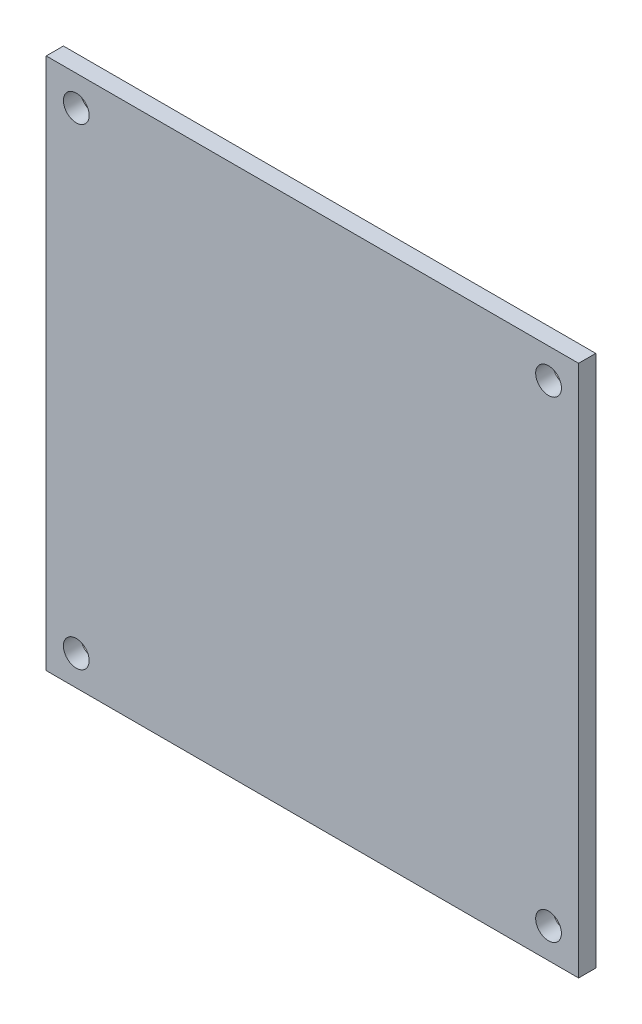
ISO-10303-21;
HEADER;
FILE_DESCRIPTION(('STEP AP214'),'2;1');
FILE_NAME('part.step','',(''),(''),'','','');
FILE_SCHEMA(('AUTOMOTIVE_DESIGN { 1 0 10303 214 1 1 1 1 }'));
ENDSEC;
DATA;
#1=APPLICATION_CONTEXT('core data for automotive mechanical design processes');
#2=APPLICATION_PROTOCOL_DEFINITION('international standard','automotive_design',2000,#1);
#3=PRODUCT_CONTEXT('',#1,'mechanical');
#4=PRODUCT('Part','Part','',(#3));
#5=PRODUCT_RELATED_PRODUCT_CATEGORY('part','',(#4));
#6=PRODUCT_DEFINITION_FORMATION('','',#4);
#7=PRODUCT_DEFINITION_CONTEXT('part definition',#1,'design');
#8=PRODUCT_DEFINITION('design','',#6,#7);
#9=PRODUCT_DEFINITION_SHAPE('','',#8);
#10=(LENGTH_UNIT() NAMED_UNIT(*) SI_UNIT(.MILLI.,.METRE.));
#11=(NAMED_UNIT(*) PLANE_ANGLE_UNIT() SI_UNIT($,.RADIAN.));
#12=(NAMED_UNIT(*) SI_UNIT($,.STERADIAN.) SOLID_ANGLE_UNIT());
#13=UNCERTAINTY_MEASURE_WITH_UNIT(LENGTH_MEASURE(1.E-05),#10,'distance_accuracy_value','');
#14=(GEOMETRIC_REPRESENTATION_CONTEXT(3) GLOBAL_UNCERTAINTY_ASSIGNED_CONTEXT((#13)) GLOBAL_UNIT_ASSIGNED_CONTEXT((#10,
#11,#12)) REPRESENTATION_CONTEXT('',''));
#15=CARTESIAN_POINT('',(0.,0.,0.));
#16=DIRECTION('',(0.,0.,1.));
#17=DIRECTION('',(1.,0.,0.));
#18=AXIS2_PLACEMENT_3D('',#15,#16,#17);
#19=CARTESIAN_POINT('',(0.,0.,0.));
#20=DIRECTION('',(0.,0.,1.));
#21=DIRECTION('',(1.,0.,0.));
#22=AXIS2_PLACEMENT_3D('',#19,#20,#21);
#23=PLANE('',#22);
#24=DIRECTION('',(0.,-1.,0.));
#25=VECTOR('',#24,1.);
#26=CARTESIAN_POINT('',(-89.1418845188909,30.4888268156425,0.));
#27=LINE('',#26,#25);
#28=CARTESIAN_POINT('',(-89.1418845188909,30.4888268156425,0.));
#29=VERTEX_POINT('',#28);
#30=CARTESIAN_POINT('',(-89.1418845188909,-31.5111731843575,0.));
#31=VERTEX_POINT('',#30);
#32=EDGE_CURVE('E212',#29,#31,#27,.T.);
#33=ORIENTED_EDGE('',*,*,#32,.F.);
#34=DIRECTION('',(-1.,0.,0.));
#35=VECTOR('',#34,1.);
#36=CARTESIAN_POINT('',(-89.1418845188909,30.4888268156425,0.));
#37=LINE('',#36,#35);
#38=CARTESIAN_POINT('',(-27.1418845188909,30.4888268156425,0.));
#39=VERTEX_POINT('',#38);
#40=EDGE_CURVE('E219',#39,#29,#37,.T.);
#41=ORIENTED_EDGE('',*,*,#40,.F.);
#42=DIRECTION('',(0.,1.,0.));
#43=VECTOR('',#42,1.);
#44=CARTESIAN_POINT('',(-27.1418845188909,30.4888268156425,0.));
#45=LINE('',#44,#43);
#46=CARTESIAN_POINT('',(-27.1418845188909,-31.5111731843575,0.));
#47=VERTEX_POINT('',#46);
#48=EDGE_CURVE('E230',#47,#39,#45,.T.);
#49=ORIENTED_EDGE('',*,*,#48,.F.);
#50=DIRECTION('',(1.,0.,0.));
#51=VECTOR('',#50,1.);
#52=CARTESIAN_POINT('',(-89.1418845188909,-31.5111731843575,0.));
#53=LINE('',#52,#51);
#54=EDGE_CURVE('E228',#31,#47,#53,.T.);
#55=ORIENTED_EDGE('',*,*,#54,.F.);
#56=EDGE_LOOP('',(#33,#41,#49,#55));
#57=FACE_BOUND('',#56,.T.);
#58=CARTESIAN_POINT('',(-85.6418845188909,26.9888268156425,0.));
#59=DIRECTION('',(0.,0.,1.));
#60=DIRECTION('',(1.,0.,0.));
#61=AXIS2_PLACEMENT_3D('',#58,#59,#60);
#62=CIRCLE('',#61,1.5);
#63=CARTESIAN_POINT('',(-84.1418845188909,26.9888268156425,0.));
#64=VERTEX_POINT('',#63);
#65=EDGE_CURVE('E206',#64,#64,#62,.T.);
#66=ORIENTED_EDGE('',*,*,#65,.T.);
#67=EDGE_LOOP('',(#66));
#68=FACE_BOUND('',#67,.T.);
#69=CARTESIAN_POINT('',(-30.6418845188909,26.9888268156425,0.));
#70=DIRECTION('',(0.,0.,1.));
#71=DIRECTION('',(1.,0.,0.));
#72=AXIS2_PLACEMENT_3D('',#69,#70,#71);
#73=CIRCLE('',#72,1.5);
#74=CARTESIAN_POINT('',(-29.1418845188909,26.9888268156425,0.));
#75=VERTEX_POINT('',#74);
#76=EDGE_CURVE('E200',#75,#75,#73,.T.);
#77=ORIENTED_EDGE('',*,*,#76,.T.);
#78=EDGE_LOOP('',(#77));
#79=FACE_BOUND('',#78,.T.);
#80=CARTESIAN_POINT('',(-30.6418845188903,-28.0111731843575,0.));
#81=DIRECTION('',(0.,0.,1.));
#82=DIRECTION('',(1.,0.,0.));
#83=AXIS2_PLACEMENT_3D('',#80,#81,#82);
#84=CIRCLE('',#83,1.5);
#85=CARTESIAN_POINT('',(-29.1418845188903,-28.0111731843575,0.));
#86=VERTEX_POINT('',#85);
#87=EDGE_CURVE('E194',#86,#86,#84,.T.);
#88=ORIENTED_EDGE('',*,*,#87,.T.);
#89=EDGE_LOOP('',(#88));
#90=FACE_BOUND('',#89,.T.);
#91=CARTESIAN_POINT('',(-85.6418845188903,-28.0111731843575,0.));
#92=DIRECTION('',(0.,0.,1.));
#93=DIRECTION('',(1.,0.,0.));
#94=AXIS2_PLACEMENT_3D('',#91,#92,#93);
#95=CIRCLE('',#94,1.5);
#96=CARTESIAN_POINT('',(-84.1418845188903,-28.0111731843575,0.));
#97=VERTEX_POINT('',#96);
#98=EDGE_CURVE('E190',#97,#97,#95,.T.);
#99=ORIENTED_EDGE('',*,*,#98,.T.);
#100=EDGE_LOOP('',(#99));
#101=FACE_BOUND('',#100,.T.);
#102=DIRECTION('',(0.,1.,0.));
#103=VECTOR('',#102,1.);
#104=CARTESIAN_POINT('',(-84.1418845188909,-12.0111731843575,0.));
#105=LINE('',#104,#103);
#106=CARTESIAN_POINT('',(-84.1418845188909,-12.0111731843575,0.));
#107=VERTEX_POINT('',#106);
#108=CARTESIAN_POINT('',(-84.1418845188909,10.9888268156425,0.));
#109=VERTEX_POINT('',#108);
#110=EDGE_CURVE('E139',#107,#109,#105,.T.);
#111=ORIENTED_EDGE('',*,*,#110,.F.);
#112=DIRECTION('',(-1.,0.,0.));
#113=VECTOR('',#112,1.);
#114=CARTESIAN_POINT('',(-84.1418845188909,-12.0111731843575,0.));
#115=LINE('',#114,#113);
#116=CARTESIAN_POINT('',(-78.1418845188909,-12.0111731843575,0.));
#117=VERTEX_POINT('',#116);
#118=EDGE_CURVE('E167',#117,#107,#115,.T.);
#119=ORIENTED_EDGE('',*,*,#118,.F.);
#120=DIRECTION('',(0.,-1.,0.));
#121=VECTOR('',#120,1.);
#122=CARTESIAN_POINT('',(-78.1418845188909,-12.0111731843575,0.));
#123=LINE('',#122,#121);
#124=CARTESIAN_POINT('',(-78.1418845188909,10.9888268156425,0.));
#125=VERTEX_POINT('',#124);
#126=EDGE_CURVE('E53',#125,#117,#123,.T.);
#127=ORIENTED_EDGE('',*,*,#126,.F.);
#128=DIRECTION('',(1.,0.,0.));
#129=VECTOR('',#128,1.);
#130=CARTESIAN_POINT('',(-84.1418845188909,10.9888268156425,0.));
#131=LINE('',#130,#129);
#132=EDGE_CURVE('E48',#109,#125,#131,.T.);
#133=ORIENTED_EDGE('',*,*,#132,.F.);
#134=EDGE_LOOP('',(#111,#119,#127,#133));
#135=FACE_BOUND('',#134,.T.);
#136=ADVANCED_FACE('F33',(#57,#68,#79,#90,#101,#135),#23,.F.);
#137=CARTESIAN_POINT('',(0.,0.,2.));
#138=DIRECTION('',(0.,0.,1.));
#139=DIRECTION('',(1.,0.,0.));
#140=AXIS2_PLACEMENT_3D('',#137,#138,#139);
#141=PLANE('',#140);
#142=CARTESIAN_POINT('',(-30.6418845188903,-28.0111731843575,2.));
#143=DIRECTION('',(0.,0.,1.));
#144=DIRECTION('',(1.,0.,0.));
#145=AXIS2_PLACEMENT_3D('',#142,#143,#144);
#146=CIRCLE('',#145,1.5);
#147=CARTESIAN_POINT('',(-29.1418845188903,-28.0111731843575,2.));
#148=VERTEX_POINT('',#147);
#149=EDGE_CURVE('E197',#148,#148,#146,.T.);
#150=ORIENTED_EDGE('',*,*,#149,.F.);
#151=EDGE_LOOP('',(#150));
#152=FACE_BOUND('',#151,.T.);
#153=CARTESIAN_POINT('',(-85.6418845188909,26.9888268156425,2.));
#154=DIRECTION('',(0.,0.,1.));
#155=DIRECTION('',(1.,0.,0.));
#156=AXIS2_PLACEMENT_3D('',#153,#154,#155);
#157=CIRCLE('',#156,1.5);
#158=CARTESIAN_POINT('',(-84.1418845188909,26.9888268156425,2.));
#159=VERTEX_POINT('',#158);
#160=EDGE_CURVE('E209',#159,#159,#157,.T.);
#161=ORIENTED_EDGE('',*,*,#160,.F.);
#162=EDGE_LOOP('',(#161));
#163=FACE_BOUND('',#162,.T.);
#164=DIRECTION('',(0.,-1.,0.));
#165=VECTOR('',#164,1.);
#166=CARTESIAN_POINT('',(-89.1418845188909,30.4888268156425,2.));
#167=LINE('',#166,#165);
#168=CARTESIAN_POINT('',(-89.1418845188909,30.4888268156425,2.));
#169=VERTEX_POINT('',#168);
#170=CARTESIAN_POINT('',(-89.1418845188909,-31.5111731843575,2.));
#171=VERTEX_POINT('',#170);
#172=EDGE_CURVE('E215',#169,#171,#167,.T.);
#173=ORIENTED_EDGE('',*,*,#172,.T.);
#174=DIRECTION('',(1.,0.,0.));
#175=VECTOR('',#174,1.);
#176=CARTESIAN_POINT('',(-89.1418845188909,-31.5111731843575,2.));
#177=LINE('',#176,#175);
#178=CARTESIAN_POINT('',(-27.1418845188909,-31.5111731843575,2.));
#179=VERTEX_POINT('',#178);
#180=EDGE_CURVE('E218',#171,#179,#177,.T.);
#181=ORIENTED_EDGE('',*,*,#180,.T.);
#182=DIRECTION('',(0.,1.,0.));
#183=VECTOR('',#182,1.);
#184=CARTESIAN_POINT('',(-27.1418845188909,30.4888268156425,2.));
#185=LINE('',#184,#183);
#186=CARTESIAN_POINT('',(-27.1418845188909,30.4888268156425,2.));
#187=VERTEX_POINT('',#186);
#188=EDGE_CURVE('E221',#179,#187,#185,.T.);
#189=ORIENTED_EDGE('',*,*,#188,.T.);
#190=DIRECTION('',(-1.,0.,0.));
#191=VECTOR('',#190,1.);
#192=CARTESIAN_POINT('',(-89.1418845188909,30.4888268156425,2.));
#193=LINE('',#192,#191);
#194=EDGE_CURVE('E223',#187,#169,#193,.T.);
#195=ORIENTED_EDGE('',*,*,#194,.T.);
#196=EDGE_LOOP('',(#173,#181,#189,#195));
#197=FACE_BOUND('',#196,.T.);
#198=CARTESIAN_POINT('',(-30.6418845188909,26.9888268156425,2.));
#199=DIRECTION('',(0.,0.,1.));
#200=DIRECTION('',(1.,0.,0.));
#201=AXIS2_PLACEMENT_3D('',#198,#199,#200);
#202=CIRCLE('',#201,1.5);
#203=CARTESIAN_POINT('',(-29.1418845188909,26.9888268156425,2.));
#204=VERTEX_POINT('',#203);
#205=EDGE_CURVE('E203',#204,#204,#202,.T.);
#206=ORIENTED_EDGE('',*,*,#205,.F.);
#207=EDGE_LOOP('',(#206));
#208=FACE_BOUND('',#207,.T.);
#209=CARTESIAN_POINT('',(-85.6418845188903,-28.0111731843575,2.));
#210=DIRECTION('',(0.,0.,1.));
#211=DIRECTION('',(1.,0.,0.));
#212=AXIS2_PLACEMENT_3D('',#209,#210,#211);
#213=CIRCLE('',#212,1.5);
#214=CARTESIAN_POINT('',(-84.1418845188903,-28.0111731843575,2.));
#215=VERTEX_POINT('',#214);
#216=EDGE_CURVE('E191',#215,#215,#213,.T.);
#217=ORIENTED_EDGE('',*,*,#216,.F.);
#218=EDGE_LOOP('',(#217));
#219=FACE_BOUND('',#218,.T.);
#220=ADVANCED_FACE('F257',(#152,#163,#197,#208,#219),#141,.T.);
#221=CARTESIAN_POINT('',(-89.1418845188909,30.4888268156425,2.));
#222=DIRECTION('',(1.,0.,0.));
#223=DIRECTION('',(0.,1.,0.));
#224=AXIS2_PLACEMENT_3D('',#221,#222,#223);
#225=PLANE('',#224);
#226=ORIENTED_EDGE('',*,*,#32,.T.);
#227=DIRECTION('',(0.,0.,-1.));
#228=VECTOR('',#227,1.);
#229=CARTESIAN_POINT('',(-89.1418845188909,-31.5111731843575,2.));
#230=LINE('',#229,#228);
#231=EDGE_CURVE('E11',#171,#31,#230,.T.);
#232=ORIENTED_EDGE('',*,*,#231,.F.);
#233=ORIENTED_EDGE('',*,*,#172,.F.);
#234=DIRECTION('',(0.,0.,-1.));
#235=VECTOR('',#234,1.);
#236=CARTESIAN_POINT('',(-89.1418845188909,30.4888268156425,2.));
#237=LINE('',#236,#235);
#238=EDGE_CURVE('E225',#169,#29,#237,.T.);
#239=ORIENTED_EDGE('',*,*,#238,.T.);
#240=EDGE_LOOP('',(#226,#232,#233,#239));
#241=FACE_BOUND('',#240,.T.);
#242=ADVANCED_FACE('F35',(#241),#225,.F.);
#243=CARTESIAN_POINT('',(-89.1418845188909,-31.5111731843575,2.));
#244=DIRECTION('',(0.,1.,0.));
#245=DIRECTION('',(0.,0.,1.));
#246=AXIS2_PLACEMENT_3D('',#243,#244,#245);
#247=PLANE('',#246);
#248=ORIENTED_EDGE('',*,*,#54,.T.);
#249=DIRECTION('',(0.,0.,-1.));
#250=VECTOR('',#249,1.);
#251=CARTESIAN_POINT('',(-27.1418845188909,-31.5111731843575,2.));
#252=LINE('',#251,#250);
#253=EDGE_CURVE('E41',#179,#47,#252,.T.);
#254=ORIENTED_EDGE('',*,*,#253,.F.);
#255=ORIENTED_EDGE('',*,*,#180,.F.);
#256=ORIENTED_EDGE('',*,*,#231,.T.);
#257=EDGE_LOOP('',(#248,#254,#255,#256));
#258=FACE_BOUND('',#257,.T.);
#259=ADVANCED_FACE('F259',(#258),#247,.F.);
#260=CARTESIAN_POINT('',(-27.1418845188909,30.4888268156425,2.));
#261=DIRECTION('',(-1.,0.,0.));
#262=DIRECTION('',(0.,-1.,0.));
#263=AXIS2_PLACEMENT_3D('',#260,#261,#262);
#264=PLANE('',#263);
#265=ORIENTED_EDGE('',*,*,#48,.T.);
#266=DIRECTION('',(0.,0.,-1.));
#267=VECTOR('',#266,1.);
#268=CARTESIAN_POINT('',(-27.1418845188909,30.4888268156425,2.));
#269=LINE('',#268,#267);
#270=EDGE_CURVE('E235',#187,#39,#269,.T.);
#271=ORIENTED_EDGE('',*,*,#270,.F.);
#272=ORIENTED_EDGE('',*,*,#188,.F.);
#273=ORIENTED_EDGE('',*,*,#253,.T.);
#274=EDGE_LOOP('',(#265,#271,#272,#273));
#275=FACE_BOUND('',#274,.T.);
#276=ADVANCED_FACE('F242',(#275),#264,.F.);
#277=CARTESIAN_POINT('',(-89.1418845188909,30.4888268156425,2.));
#278=DIRECTION('',(0.,-1.,0.));
#279=DIRECTION('',(0.,0.,-1.));
#280=AXIS2_PLACEMENT_3D('',#277,#278,#279);
#281=PLANE('',#280);
#282=ORIENTED_EDGE('',*,*,#40,.T.);
#283=ORIENTED_EDGE('',*,*,#238,.F.);
#284=ORIENTED_EDGE('',*,*,#194,.F.);
#285=ORIENTED_EDGE('',*,*,#270,.T.);
#286=EDGE_LOOP('',(#282,#283,#284,#285));
#287=FACE_BOUND('',#286,.T.);
#288=ADVANCED_FACE('F251',(#287),#281,.F.);
#289=CARTESIAN_POINT('',(-85.6418845188909,26.9888268156425,2.));
#290=DIRECTION('',(0.,0.,-1.));
#291=DIRECTION('',(-1.,0.,0.));
#292=AXIS2_PLACEMENT_3D('',#289,#290,#291);
#293=CYLINDRICAL_SURFACE('',#292,1.5);
#294=ORIENTED_EDGE('',*,*,#160,.T.);
#295=EDGE_LOOP('',(#294));
#296=FACE_BOUND('',#295,.T.);
#297=ORIENTED_EDGE('',*,*,#65,.F.);
#298=EDGE_LOOP('',(#297));
#299=FACE_BOUND('',#298,.T.);
#300=ADVANCED_FACE('F326',(#296,#299),#293,.F.);
#301=CARTESIAN_POINT('',(-30.6418845188909,26.9888268156425,2.));
#302=DIRECTION('',(0.,0.,-1.));
#303=DIRECTION('',(-1.,0.,0.));
#304=AXIS2_PLACEMENT_3D('',#301,#302,#303);
#305=CYLINDRICAL_SURFACE('',#304,1.5);
#306=ORIENTED_EDGE('',*,*,#205,.T.);
#307=EDGE_LOOP('',(#306));
#308=FACE_BOUND('',#307,.T.);
#309=ORIENTED_EDGE('',*,*,#76,.F.);
#310=EDGE_LOOP('',(#309));
#311=FACE_BOUND('',#310,.T.);
#312=ADVANCED_FACE('F322',(#308,#311),#305,.F.);
#313=CARTESIAN_POINT('',(-30.6418845188903,-28.0111731843575,2.));
#314=DIRECTION('',(0.,0.,-1.));
#315=DIRECTION('',(-1.,0.,0.));
#316=AXIS2_PLACEMENT_3D('',#313,#314,#315);
#317=CYLINDRICAL_SURFACE('',#316,1.5);
#318=ORIENTED_EDGE('',*,*,#149,.T.);
#319=EDGE_LOOP('',(#318));
#320=FACE_BOUND('',#319,.T.);
#321=ORIENTED_EDGE('',*,*,#87,.F.);
#322=EDGE_LOOP('',(#321));
#323=FACE_BOUND('',#322,.T.);
#324=ADVANCED_FACE('F318',(#320,#323),#317,.F.);
#325=CARTESIAN_POINT('',(-85.6418845188903,-28.0111731843575,2.));
#326=DIRECTION('',(0.,0.,-1.));
#327=DIRECTION('',(-1.,0.,0.));
#328=AXIS2_PLACEMENT_3D('',#325,#326,#327);
#329=CYLINDRICAL_SURFACE('',#328,1.5);
#330=ORIENTED_EDGE('',*,*,#216,.T.);
#331=EDGE_LOOP('',(#330));
#332=FACE_BOUND('',#331,.T.);
#333=ORIENTED_EDGE('',*,*,#98,.F.);
#334=EDGE_LOOP('',(#333));
#335=FACE_BOUND('',#334,.T.);
#336=ADVANCED_FACE('F300',(#332,#335),#329,.F.);
#337=CARTESIAN_POINT('',(0.,0.,-10.));
#338=DIRECTION('',(0.,0.,-1.));
#339=DIRECTION('',(-1.,0.,0.));
#340=AXIS2_PLACEMENT_3D('',#337,#338,#339);
#341=PLANE('',#340);
#342=DIRECTION('',(0.,1.,0.));
#343=VECTOR('',#342,1.);
#344=CARTESIAN_POINT('',(-84.1418845188909,-12.0111731843575,-10.));
#345=LINE('',#344,#343);
#346=CARTESIAN_POINT('',(-84.1418845188909,-12.0111731843575,-10.));
#347=VERTEX_POINT('',#346);
#348=CARTESIAN_POINT('',(-84.1418845188909,10.9888268156425,-10.));
#349=VERTEX_POINT('',#348);
#350=EDGE_CURVE('E163',#347,#349,#345,.T.);
#351=ORIENTED_EDGE('',*,*,#350,.T.);
#352=DIRECTION('',(1.,0.,0.));
#353=VECTOR('',#352,1.);
#354=CARTESIAN_POINT('',(-84.1418845188909,10.9888268156425,-10.));
#355=LINE('',#354,#353);
#356=CARTESIAN_POINT('',(-78.1418845188909,10.9888268156425,-10.));
#357=VERTEX_POINT('',#356);
#358=EDGE_CURVE('E166',#349,#357,#355,.T.);
#359=ORIENTED_EDGE('',*,*,#358,.T.);
#360=DIRECTION('',(0.,-1.,0.));
#361=VECTOR('',#360,1.);
#362=CARTESIAN_POINT('',(-78.1418845188909,-12.0111731843575,-10.));
#363=LINE('',#362,#361);
#364=CARTESIAN_POINT('',(-78.1418845188909,-12.0111731843575,-10.));
#365=VERTEX_POINT('',#364);
#366=EDGE_CURVE('E169',#357,#365,#363,.T.);
#367=ORIENTED_EDGE('',*,*,#366,.T.);
#368=DIRECTION('',(-1.,0.,0.));
#369=VECTOR('',#368,1.);
#370=CARTESIAN_POINT('',(-84.1418845188909,-12.0111731843575,-10.));
#371=LINE('',#370,#369);
#372=EDGE_CURVE('E171',#365,#347,#371,.T.);
#373=ORIENTED_EDGE('',*,*,#372,.T.);
#374=EDGE_LOOP('',(#351,#359,#367,#373));
#375=FACE_BOUND('',#374,.T.);
#376=DIRECTION('',(1.,0.,0.));
#377=VECTOR('',#376,1.);
#378=CARTESIAN_POINT('',(-82.1418845188909,9.73882681564247,-10.));
#379=LINE('',#378,#377);
#380=CARTESIAN_POINT('',(-82.1418845188909,9.73882681564247,-10.));
#381=VERTEX_POINT('',#380);
#382=CARTESIAN_POINT('',(-80.1418845188909,9.73882681564247,-10.));
#383=VERTEX_POINT('',#382);
#384=EDGE_CURVE('E131',#381,#383,#379,.T.);
#385=ORIENTED_EDGE('',*,*,#384,.F.);
#386=DIRECTION('',(0.,1.,0.));
#387=VECTOR('',#386,1.);
#388=CARTESIAN_POINT('',(-82.1418845188909,-10.7611731843575,-10.));
#389=LINE('',#388,#387);
#390=CARTESIAN_POINT('',(-82.1418845188909,-10.7611731843575,-10.));
#391=VERTEX_POINT('',#390);
#392=EDGE_CURVE('E121',#391,#381,#389,.T.);
#393=ORIENTED_EDGE('',*,*,#392,.F.);
#394=DIRECTION('',(-1.,0.,0.));
#395=VECTOR('',#394,1.);
#396=CARTESIAN_POINT('',(-82.1418845188909,-10.7611731843575,-10.));
#397=LINE('',#396,#395);
#398=CARTESIAN_POINT('',(-80.1418845188909,-10.7611731843575,-10.));
#399=VERTEX_POINT('',#398);
#400=EDGE_CURVE('E147',#399,#391,#397,.T.);
#401=ORIENTED_EDGE('',*,*,#400,.F.);
#402=DIRECTION('',(0.,-1.,0.));
#403=VECTOR('',#402,1.);
#404=CARTESIAN_POINT('',(-80.1418845188909,-10.7611731843575,-10.));
#405=LINE('',#404,#403);
#406=EDGE_CURVE('E145',#383,#399,#405,.T.);
#407=ORIENTED_EDGE('',*,*,#406,.F.);
#408=EDGE_LOOP('',(#385,#393,#401,#407));
#409=FACE_BOUND('',#408,.T.);
#410=ADVANCED_FACE('F143',(#375,#409),#341,.T.);
#411=CARTESIAN_POINT('',(-84.1418845188909,-12.0111731843575,-10.));
#412=DIRECTION('',(1.,0.,0.));
#413=DIRECTION('',(0.,1.,0.));
#414=AXIS2_PLACEMENT_3D('',#411,#412,#413);
#415=PLANE('',#414);
#416=ORIENTED_EDGE('',*,*,#110,.T.);
#417=DIRECTION('',(0.,0.,1.));
#418=VECTOR('',#417,1.);
#419=CARTESIAN_POINT('',(-84.1418845188909,10.9888268156425,-10.));
#420=LINE('',#419,#418);
#421=EDGE_CURVE('E188',#349,#109,#420,.T.);
#422=ORIENTED_EDGE('',*,*,#421,.F.);
#423=ORIENTED_EDGE('',*,*,#350,.F.);
#424=DIRECTION('',(0.,0.,1.));
#425=VECTOR('',#424,1.);
#426=CARTESIAN_POINT('',(-84.1418845188909,-12.0111731843575,-10.));
#427=LINE('',#426,#425);
#428=EDGE_CURVE('E173',#347,#107,#427,.T.);
#429=ORIENTED_EDGE('',*,*,#428,.T.);
#430=EDGE_LOOP('',(#416,#422,#423,#429));
#431=FACE_BOUND('',#430,.T.);
#432=ADVANCED_FACE('F299',(#431),#415,.F.);
#433=CARTESIAN_POINT('',(-84.1418845188909,10.9888268156425,-10.));
#434=DIRECTION('',(0.,-1.,0.));
#435=DIRECTION('',(0.,0.,-1.));
#436=AXIS2_PLACEMENT_3D('',#433,#434,#435);
#437=PLANE('',#436);
#438=ORIENTED_EDGE('',*,*,#132,.T.);
#439=DIRECTION('',(0.,0.,1.));
#440=VECTOR('',#439,1.);
#441=CARTESIAN_POINT('',(-78.1418845188909,10.9888268156425,-10.));
#442=LINE('',#441,#440);
#443=EDGE_CURVE('E185',#357,#125,#442,.T.);
#444=ORIENTED_EDGE('',*,*,#443,.F.);
#445=ORIENTED_EDGE('',*,*,#358,.F.);
#446=ORIENTED_EDGE('',*,*,#421,.T.);
#447=EDGE_LOOP('',(#438,#444,#445,#446));
#448=FACE_BOUND('',#447,.T.);
#449=ADVANCED_FACE('F308',(#448),#437,.F.);
#450=CARTESIAN_POINT('',(-78.1418845188909,-12.0111731843575,-10.));
#451=DIRECTION('',(-1.,0.,0.));
#452=DIRECTION('',(0.,0.,1.));
#453=AXIS2_PLACEMENT_3D('',#450,#451,#452);
#454=PLANE('',#453);
#455=ORIENTED_EDGE('',*,*,#126,.T.);
#456=DIRECTION('',(0.,0.,1.));
#457=VECTOR('',#456,1.);
#458=CARTESIAN_POINT('',(-78.1418845188909,-12.0111731843575,-10.));
#459=LINE('',#458,#457);
#460=EDGE_CURVE('E182',#365,#117,#459,.T.);
#461=ORIENTED_EDGE('',*,*,#460,.F.);
#462=ORIENTED_EDGE('',*,*,#366,.F.);
#463=ORIENTED_EDGE('',*,*,#443,.T.);
#464=EDGE_LOOP('',(#455,#461,#462,#463));
#465=FACE_BOUND('',#464,.T.);
#466=ADVANCED_FACE('F304',(#465),#454,.F.);
#467=CARTESIAN_POINT('',(-84.1418845188909,-12.0111731843575,-10.));
#468=DIRECTION('',(0.,1.,0.));
#469=DIRECTION('',(-1.,0.,0.));
#470=AXIS2_PLACEMENT_3D('',#467,#468,#469);
#471=PLANE('',#470);
#472=ORIENTED_EDGE('',*,*,#118,.T.);
#473=ORIENTED_EDGE('',*,*,#428,.F.);
#474=ORIENTED_EDGE('',*,*,#372,.F.);
#475=ORIENTED_EDGE('',*,*,#460,.T.);
#476=EDGE_LOOP('',(#472,#473,#474,#475));
#477=FACE_BOUND('',#476,.T.);
#478=ADVANCED_FACE('F296',(#477),#471,.F.);
#479=CARTESIAN_POINT('',(-82.1418845188909,-10.7611731843575,-10.));
#480=DIRECTION('',(1.,0.,0.));
#481=DIRECTION('',(0.,0.,-1.));
#482=AXIS2_PLACEMENT_3D('',#479,#480,#481);
#483=PLANE('',#482);
#484=DIRECTION('',(0.,1.,0.));
#485=VECTOR('',#484,1.);
#486=CARTESIAN_POINT('',(-82.1418845188909,-10.7611731843575,0.));
#487=LINE('',#486,#485);
#488=CARTESIAN_POINT('',(-82.1418845188909,-10.7611731843575,0.));
#489=VERTEX_POINT('',#488);
#490=CARTESIAN_POINT('',(-82.1418845188909,9.73882681564247,0.));
#491=VERTEX_POINT('',#490);
#492=EDGE_CURVE('E151',#489,#491,#487,.T.);
#493=ORIENTED_EDGE('',*,*,#492,.F.);
#494=DIRECTION('',(0.,0.,1.));
#495=VECTOR('',#494,1.);
#496=CARTESIAN_POINT('',(-82.1418845188909,-10.7611731843575,-10.));
#497=LINE('',#496,#495);
#498=EDGE_CURVE('E127',#391,#489,#497,.T.);
#499=ORIENTED_EDGE('',*,*,#498,.F.);
#500=ORIENTED_EDGE('',*,*,#392,.T.);
#501=DIRECTION('',(0.,0.,1.));
#502=VECTOR('',#501,1.);
#503=CARTESIAN_POINT('',(-82.1418845188909,9.73882681564247,-10.));
#504=LINE('',#503,#502);
#505=EDGE_CURVE('E125',#381,#491,#504,.T.);
#506=ORIENTED_EDGE('',*,*,#505,.T.);
#507=EDGE_LOOP('',(#493,#499,#500,#506));
#508=FACE_BOUND('',#507,.T.);
#509=ADVANCED_FACE('F124',(#508),#483,.T.);
#510=CARTESIAN_POINT('',(-82.1418845188909,9.73882681564247,-10.));
#511=DIRECTION('',(0.,-1.,0.));
#512=DIRECTION('',(0.,0.,-1.));
#513=AXIS2_PLACEMENT_3D('',#510,#511,#512);
#514=PLANE('',#513);
#515=DIRECTION('',(1.,0.,0.));
#516=VECTOR('',#515,1.);
#517=CARTESIAN_POINT('',(-82.1418845188909,9.73882681564247,0.));
#518=LINE('',#517,#516);
#519=CARTESIAN_POINT('',(-80.1418845188909,9.73882681564247,0.));
#520=VERTEX_POINT('',#519);
#521=EDGE_CURVE('E138',#491,#520,#518,.T.);
#522=ORIENTED_EDGE('',*,*,#521,.F.);
#523=ORIENTED_EDGE('',*,*,#505,.F.);
#524=ORIENTED_EDGE('',*,*,#384,.T.);
#525=DIRECTION('',(0.,0.,1.));
#526=VECTOR('',#525,1.);
#527=CARTESIAN_POINT('',(-80.1418845188909,9.73882681564247,-10.));
#528=LINE('',#527,#526);
#529=EDGE_CURVE('E140',#383,#520,#528,.T.);
#530=ORIENTED_EDGE('',*,*,#529,.T.);
#531=EDGE_LOOP('',(#522,#523,#524,#530));
#532=FACE_BOUND('',#531,.T.);
#533=ADVANCED_FACE('F135',(#532),#514,.T.);
#534=CARTESIAN_POINT('',(-80.1418845188909,-10.7611731843575,-10.));
#535=DIRECTION('',(-1.,0.,0.));
#536=DIRECTION('',(0.,0.,1.));
#537=AXIS2_PLACEMENT_3D('',#534,#535,#536);
#538=PLANE('',#537);
#539=DIRECTION('',(0.,-1.,0.));
#540=VECTOR('',#539,1.);
#541=CARTESIAN_POINT('',(-80.1418845188909,-10.7611731843575,0.));
#542=LINE('',#541,#540);
#543=CARTESIAN_POINT('',(-80.1418845188909,-10.7611731843575,0.));
#544=VERTEX_POINT('',#543);
#545=EDGE_CURVE('E154',#520,#544,#542,.T.);
#546=ORIENTED_EDGE('',*,*,#545,.F.);
#547=ORIENTED_EDGE('',*,*,#529,.F.);
#548=ORIENTED_EDGE('',*,*,#406,.T.);
#549=DIRECTION('',(0.,0.,1.));
#550=VECTOR('',#549,1.);
#551=CARTESIAN_POINT('',(-80.1418845188909,-10.7611731843575,-10.));
#552=LINE('',#551,#550);
#553=EDGE_CURVE('E160',#399,#544,#552,.T.);
#554=ORIENTED_EDGE('',*,*,#553,.T.);
#555=EDGE_LOOP('',(#546,#547,#548,#554));
#556=FACE_BOUND('',#555,.T.);
#557=ADVANCED_FACE('F281',(#556),#538,.T.);
#558=CARTESIAN_POINT('',(-82.1418845188909,-10.7611731843575,-10.));
#559=DIRECTION('',(0.,1.,0.));
#560=DIRECTION('',(0.,0.,1.));
#561=AXIS2_PLACEMENT_3D('',#558,#559,#560);
#562=PLANE('',#561);
#563=DIRECTION('',(-1.,0.,0.));
#564=VECTOR('',#563,1.);
#565=CARTESIAN_POINT('',(-82.1418845188909,-10.7611731843575,0.));
#566=LINE('',#565,#564);
#567=EDGE_CURVE('E132',#544,#489,#566,.T.);
#568=ORIENTED_EDGE('',*,*,#567,.F.);
#569=ORIENTED_EDGE('',*,*,#553,.F.);
#570=ORIENTED_EDGE('',*,*,#400,.T.);
#571=ORIENTED_EDGE('',*,*,#498,.T.);
#572=EDGE_LOOP('',(#568,#569,#570,#571));
#573=FACE_BOUND('',#572,.T.);
#574=ADVANCED_FACE('F276',(#573),#562,.T.);
#575=ORIENTED_EDGE('',*,*,#567,.T.);
#576=ORIENTED_EDGE('',*,*,#492,.T.);
#577=ORIENTED_EDGE('',*,*,#521,.T.);
#578=ORIENTED_EDGE('',*,*,#545,.T.);
#579=EDGE_LOOP('',(#575,#576,#577,#578));
#580=FACE_BOUND('',#579,.T.);
#581=ADVANCED_FACE('F268',(#580),#23,.F.);
#582=CLOSED_SHELL('',(#136,#220,#242,#259,#276,#288,#300,#312,#324,#336,#410,#432,#449,#466,
#478,#509,#533,#557,#574,#581));
#583=MANIFOLD_SOLID_BREP('B2',#582);
#584=ADVANCED_BREP_SHAPE_REPRESENTATION('',(#18,#583),#14);
#585=SHAPE_DEFINITION_REPRESENTATION(#9,#584);
ENDSEC;
END-ISO-10303-21;
